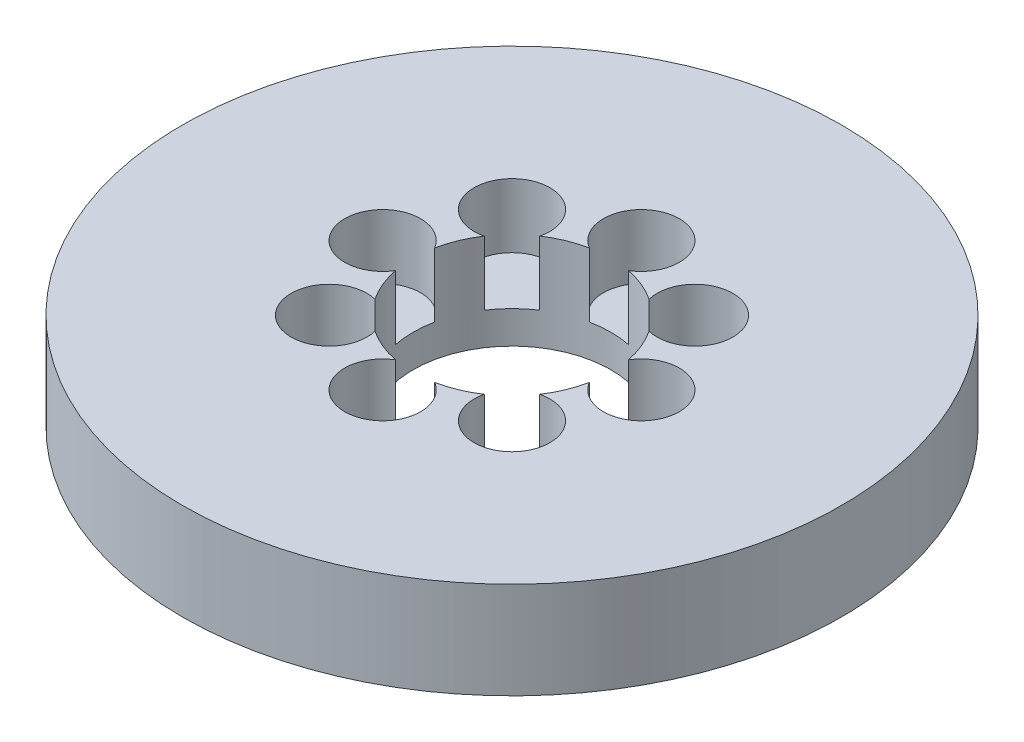
ISO-10303-21;
HEADER;
FILE_DESCRIPTION(('STEP AP214'),'2;1');
FILE_NAME('part.step','',(''),(''),'','','');
FILE_SCHEMA(('AUTOMOTIVE_DESIGN { 1 0 10303 214 1 1 1 1 }'));
ENDSEC;
DATA;
#1=APPLICATION_CONTEXT('core data for automotive mechanical design processes');
#2=APPLICATION_PROTOCOL_DEFINITION('international standard','automotive_design',2000,#1);
#3=PRODUCT_CONTEXT('',#1,'mechanical');
#4=PRODUCT('Part','Part','',(#3));
#5=PRODUCT_RELATED_PRODUCT_CATEGORY('part','',(#4));
#6=PRODUCT_DEFINITION_FORMATION('','',#4);
#7=PRODUCT_DEFINITION_CONTEXT('part definition',#1,'design');
#8=PRODUCT_DEFINITION('design','',#6,#7);
#9=PRODUCT_DEFINITION_SHAPE('','',#8);
#10=(LENGTH_UNIT() NAMED_UNIT(*) SI_UNIT(.MILLI.,.METRE.));
#11=(NAMED_UNIT(*) PLANE_ANGLE_UNIT() SI_UNIT($,.RADIAN.));
#12=(NAMED_UNIT(*) SI_UNIT($,.STERADIAN.) SOLID_ANGLE_UNIT());
#13=UNCERTAINTY_MEASURE_WITH_UNIT(LENGTH_MEASURE(1.E-05),#10,'distance_accuracy_value','');
#14=(GEOMETRIC_REPRESENTATION_CONTEXT(3) GLOBAL_UNCERTAINTY_ASSIGNED_CONTEXT((#13)) GLOBAL_UNIT_ASSIGNED_CONTEXT((#10,
#11,#12)) REPRESENTATION_CONTEXT('',''));
#15=CARTESIAN_POINT('',(0.,0.,0.));
#16=DIRECTION('',(0.,0.,1.));
#17=DIRECTION('',(1.,0.,0.));
#18=AXIS2_PLACEMENT_3D('',#15,#16,#17);
#19=CARTESIAN_POINT('',(0.,22.,0.));
#20=DIRECTION('',(0.,-1.,0.));
#21=DIRECTION('',(0.,0.,-1.));
#22=AXIS2_PLACEMENT_3D('',#19,#20,#21);
#23=CYLINDRICAL_SURFACE('',#22,75.);
#24=CARTESIAN_POINT('',(0.,22.,0.));
#25=DIRECTION('',(0.,1.,0.));
#26=DIRECTION('',(0.,0.,1.));
#27=AXIS2_PLACEMENT_3D('',#24,#25,#26);
#28=CIRCLE('',#27,75.);
#29=CARTESIAN_POINT('',(0.,22.,75.));
#30=VERTEX_POINT('',#29);
#31=EDGE_CURVE('E195',#30,#30,#28,.T.);
#32=ORIENTED_EDGE('',*,*,#31,.F.);
#33=EDGE_LOOP('',(#32));
#34=FACE_BOUND('',#33,.T.);
#35=CARTESIAN_POINT('',(0.,0.,0.));
#36=DIRECTION('',(0.,1.,0.));
#37=DIRECTION('',(0.,0.,1.));
#38=AXIS2_PLACEMENT_3D('',#35,#36,#37);
#39=CIRCLE('',#38,75.);
#40=CARTESIAN_POINT('',(0.,0.,75.));
#41=VERTEX_POINT('',#40);
#42=EDGE_CURVE('E179',#41,#41,#39,.T.);
#43=ORIENTED_EDGE('',*,*,#42,.T.);
#44=EDGE_LOOP('',(#43));
#45=FACE_BOUND('',#44,.T.);
#46=ADVANCED_FACE('F39',(#34,#45),#23,.T.);
#47=CARTESIAN_POINT('',(0.,22.,0.));
#48=DIRECTION('',(0.,1.,0.));
#49=DIRECTION('',(0.,0.,1.));
#50=AXIS2_PLACEMENT_3D('',#47,#48,#49);
#51=PLANE('',#50);
#52=CARTESIAN_POINT('',(1.02795736409459E-13,22.,29.4418690616628));
#53=DIRECTION('',(0.,1.,0.));
#54=DIRECTION('',(1.,0.,0.));
#55=AXIS2_PLACEMENT_3D('',#52,#53,#54);
#56=CIRCLE('',#55,8.63157592776677);
#57=CARTESIAN_POINT('',(-4.46210059535037,22.,22.0531099456964));
#58=VERTEX_POINT('',#57);
#59=CARTESIAN_POINT('',(4.46210059535052,22.,22.0531099456964));
#60=VERTEX_POINT('',#59);
#61=EDGE_CURVE('E176',#58,#60,#56,.T.);
#62=ORIENTED_EDGE('',*,*,#61,.F.);
#63=CARTESIAN_POINT('',(0.,22.,0.));
#64=DIRECTION('',(0.,1.,0.));
#65=DIRECTION('',(0.,0.,1.));
#66=AXIS2_PLACEMENT_3D('',#63,#64,#65);
#67=CIRCLE('',#66,22.5);
#68=CARTESIAN_POINT('',(-12.4387219995456,22.,18.7490851781633));
#69=VERTEX_POINT('',#68);
#70=EDGE_CURVE('E166',#69,#58,#67,.T.);
#71=ORIENTED_EDGE('',*,*,#70,.F.);
#72=CARTESIAN_POINT('',(-20.8185452643081,22.,20.8185452643082));
#73=DIRECTION('',(0.,1.,0.));
#74=DIRECTION('',(0.707106781186549,0.,0.707106781186546));
#75=AXIS2_PLACEMENT_3D('',#72,#73,#74);
#76=CIRCLE('',#75,8.63157592776677);
#77=CARTESIAN_POINT('',(-18.7490851781632,22.,12.4387219995456));
#78=VERTEX_POINT('',#77);
#79=EDGE_CURVE('E147',#78,#69,#76,.T.);
#80=ORIENTED_EDGE('',*,*,#79,.F.);
#81=CARTESIAN_POINT('',(-22.0531099456964,22.,4.46210059535045));
#82=VERTEX_POINT('',#81);
#83=EDGE_CURVE('E180',#82,#78,#67,.T.);
#84=ORIENTED_EDGE('',*,*,#83,.F.);
#85=CARTESIAN_POINT('',(-29.4418690616628,22.,0.));
#86=DIRECTION('',(0.,1.,0.));
#87=DIRECTION('',(0.,0.,1.));
#88=AXIS2_PLACEMENT_3D('',#85,#86,#87);
#89=CIRCLE('',#88,8.63157592776677);
#90=CARTESIAN_POINT('',(-22.0531099456964,22.,-4.46210059535045));
#91=VERTEX_POINT('',#90);
#92=EDGE_CURVE('E186',#91,#82,#89,.T.);
#93=ORIENTED_EDGE('',*,*,#92,.F.);
#94=CARTESIAN_POINT('',(-18.7490851781634,22.,-12.4387219995454));
#95=VERTEX_POINT('',#94);
#96=EDGE_CURVE('E182',#95,#91,#67,.T.);
#97=ORIENTED_EDGE('',*,*,#96,.F.);
#98=CARTESIAN_POINT('',(-20.8185452643084,22.,-20.8185452643079));
#99=DIRECTION('',(0.,1.,0.));
#100=DIRECTION('',(-0.707106781186539,0.,0.707106781186556));
#101=AXIS2_PLACEMENT_3D('',#98,#99,#100);
#102=CIRCLE('',#101,8.63157592776677);
#103=CARTESIAN_POINT('',(-12.4387219995458,22.,-18.7490851781631));
#104=VERTEX_POINT('',#103);
#105=EDGE_CURVE('E446',#104,#95,#102,.T.);
#106=ORIENTED_EDGE('',*,*,#105,.F.);
#107=CARTESIAN_POINT('',(-4.46210059535068,22.,-22.0531099456963));
#108=VERTEX_POINT('',#107);
#109=EDGE_CURVE('E452',#108,#104,#67,.T.);
#110=ORIENTED_EDGE('',*,*,#109,.F.);
#111=CARTESIAN_POINT('',(-3.08387209228376E-13,22.,-29.4418690616628));
#112=DIRECTION('',(0.,1.,0.));
#113=DIRECTION('',(-1.,0.,0.));
#114=AXIS2_PLACEMENT_3D('',#111,#112,#113);
#115=CIRCLE('',#114,8.63157592776677);
#116=CARTESIAN_POINT('',(4.46210059535022,22.,-22.0531099456964));
#117=VERTEX_POINT('',#116);
#118=EDGE_CURVE('E477',#117,#108,#115,.T.);
#119=ORIENTED_EDGE('',*,*,#118,.F.);
#120=CARTESIAN_POINT('',(12.4387219995454,22.,-18.7490851781634));
#121=VERTEX_POINT('',#120);
#122=EDGE_CURVE('E460',#121,#117,#67,.T.);
#123=ORIENTED_EDGE('',*,*,#122,.F.);
#124=CARTESIAN_POINT('',(20.818545264308,22.,-20.8185452643083));
#125=DIRECTION('',(0.,1.,0.));
#126=DIRECTION('',(-0.707106781186554,0.,-0.707106781186541));
#127=AXIS2_PLACEMENT_3D('',#124,#125,#126);
#128=CIRCLE('',#127,8.63157592776677);
#129=CARTESIAN_POINT('',(18.7490851781631,22.,-12.4387219995458));
#130=VERTEX_POINT('',#129);
#131=EDGE_CURVE('E464',#130,#121,#128,.T.);
#132=ORIENTED_EDGE('',*,*,#131,.F.);
#133=CARTESIAN_POINT('',(22.0531099456964,22.,-4.46210059535045));
#134=VERTEX_POINT('',#133);
#135=EDGE_CURVE('E459',#134,#130,#67,.T.);
#136=ORIENTED_EDGE('',*,*,#135,.F.);
#137=CARTESIAN_POINT('',(29.4418690616628,22.,0.));
#138=DIRECTION('',(0.,1.,0.));
#139=DIRECTION('',(0.,0.,-1.));
#140=AXIS2_PLACEMENT_3D('',#137,#138,#139);
#141=CIRCLE('',#140,8.63157592776677);
#142=CARTESIAN_POINT('',(22.0531099456964,22.,4.46210059535045));
#143=VERTEX_POINT('',#142);
#144=EDGE_CURVE('E469',#143,#134,#141,.T.);
#145=ORIENTED_EDGE('',*,*,#144,.F.);
#146=CARTESIAN_POINT('',(18.7490851781633,22.,12.4387219995455));
#147=VERTEX_POINT('',#146);
#148=EDGE_CURVE('E181',#147,#143,#67,.T.);
#149=ORIENTED_EDGE('',*,*,#148,.F.);
#150=CARTESIAN_POINT('',(20.8185452643083,22.,20.818545264308));
#151=DIRECTION('',(0.,1.,0.));
#152=DIRECTION('',(0.707106781186544,0.,-0.707106781186551));
#153=AXIS2_PLACEMENT_3D('',#150,#151,#152);
#154=CIRCLE('',#153,8.63157592776677);
#155=CARTESIAN_POINT('',(12.4387219995457,22.,18.7490851781632));
#156=VERTEX_POINT('',#155);
#157=EDGE_CURVE('E475',#156,#147,#154,.T.);
#158=ORIENTED_EDGE('',*,*,#157,.F.);
#159=EDGE_CURVE('E177',#60,#156,#67,.T.);
#160=ORIENTED_EDGE('',*,*,#159,.F.);
#161=EDGE_LOOP('',(#62,#71,#80,#84,#93,#97,#106,#110,#119,#123,#132,#136,#145,#149,#158,#160));
#162=FACE_BOUND('',#161,.T.);
#163=ORIENTED_EDGE('',*,*,#31,.T.);
#164=EDGE_LOOP('',(#163));
#165=FACE_BOUND('',#164,.T.);
#166=ADVANCED_FACE('F172',(#162,#165),#51,.T.);
#167=CARTESIAN_POINT('',(0.,0.,0.));
#168=DIRECTION('',(0.,1.,0.));
#169=DIRECTION('',(0.,0.,1.));
#170=AXIS2_PLACEMENT_3D('',#167,#168,#169);
#171=PLANE('',#170);
#172=CARTESIAN_POINT('',(0.,0.,0.));
#173=DIRECTION('',(0.,1.,0.));
#174=DIRECTION('',(0.,0.,1.));
#175=AXIS2_PLACEMENT_3D('',#172,#173,#174);
#176=CIRCLE('',#175,22.5);
#177=CARTESIAN_POINT('',(0.,0.,22.5));
#178=VERTEX_POINT('',#177);
#179=EDGE_CURVE('E187',#178,#178,#176,.T.);
#180=ORIENTED_EDGE('',*,*,#179,.T.);
#181=EDGE_LOOP('',(#180));
#182=FACE_BOUND('',#181,.T.);
#183=ORIENTED_EDGE('',*,*,#42,.F.);
#184=EDGE_LOOP('',(#183));
#185=FACE_BOUND('',#184,.T.);
#186=ADVANCED_FACE('F270',(#182,#185),#171,.F.);
#187=CARTESIAN_POINT('',(0.,22.,0.));
#188=DIRECTION('',(0.,-1.,0.));
#189=DIRECTION('',(0.,0.,-1.));
#190=AXIS2_PLACEMENT_3D('',#187,#188,#189);
#191=CYLINDRICAL_SURFACE('',#190,22.5);
#192=DIRECTION('',(0.,1.,0.));
#193=VECTOR('',#192,1.);
#194=CARTESIAN_POINT('',(-4.46210059535036,14.6994537194091,22.0531099456964));
#195=LINE('',#194,#193);
#196=CARTESIAN_POINT('',(-4.46210059535037,7.3989074388182,22.0531099456964));
#197=VERTEX_POINT('',#196);
#198=EDGE_CURVE('E11',#197,#58,#195,.T.);
#199=ORIENTED_EDGE('',*,*,#198,.F.);
#200=CARTESIAN_POINT('',(0.,7.3989074388182,0.));
#201=DIRECTION('',(0.,1.,0.));
#202=DIRECTION('',(0.,0.,1.));
#203=AXIS2_PLACEMENT_3D('',#200,#201,#202);
#204=CIRCLE('',#203,22.5);
#205=CARTESIAN_POINT('',(4.46210059535052,7.3989074388182,22.0531099456964));
#206=VERTEX_POINT('',#205);
#207=EDGE_CURVE('E250',#197,#206,#204,.T.);
#208=ORIENTED_EDGE('',*,*,#207,.T.);
#209=DIRECTION('',(0.,1.,0.));
#210=VECTOR('',#209,1.);
#211=CARTESIAN_POINT('',(4.46210059535052,14.6994537194091,22.0531099456964));
#212=LINE('',#211,#210);
#213=EDGE_CURVE('E46',#60,#206,#212,.F.);
#214=ORIENTED_EDGE('',*,*,#213,.F.);
#215=ORIENTED_EDGE('',*,*,#159,.T.);
#216=DIRECTION('',(0.,1.,0.));
#217=VECTOR('',#216,1.);
#218=CARTESIAN_POINT('',(12.4387219995457,14.6994537194091,18.7490851781632));
#219=LINE('',#218,#217);
#220=CARTESIAN_POINT('',(12.4387219995457,7.3989074388182,18.7490851781632));
#221=VERTEX_POINT('',#220);
#222=EDGE_CURVE('E244',#221,#156,#219,.T.);
#223=ORIENTED_EDGE('',*,*,#222,.F.);
#224=CARTESIAN_POINT('',(0.,7.3989074388182,0.));
#225=DIRECTION('',(0.,1.,0.));
#226=DIRECTION('',(0.,0.,1.));
#227=AXIS2_PLACEMENT_3D('',#224,#225,#226);
#228=CIRCLE('',#227,22.5);
#229=CARTESIAN_POINT('',(18.7490851781633,7.3989074388182,12.4387219995455));
#230=VERTEX_POINT('',#229);
#231=EDGE_CURVE('E238',#221,#230,#228,.T.);
#232=ORIENTED_EDGE('',*,*,#231,.T.);
#233=DIRECTION('',(0.,1.,0.));
#234=VECTOR('',#233,1.);
#235=CARTESIAN_POINT('',(18.7490851781633,14.6994537194091,12.4387219995455));
#236=LINE('',#235,#234);
#237=EDGE_CURVE('E242',#147,#230,#236,.F.);
#238=ORIENTED_EDGE('',*,*,#237,.F.);
#239=ORIENTED_EDGE('',*,*,#148,.T.);
#240=DIRECTION('',(0.,1.,0.));
#241=VECTOR('',#240,1.);
#242=CARTESIAN_POINT('',(22.0531099456964,14.6994537194091,4.46210059535044));
#243=LINE('',#242,#241);
#244=CARTESIAN_POINT('',(22.0531099456964,7.3989074388182,4.46210059535045));
#245=VERTEX_POINT('',#244);
#246=EDGE_CURVE('E236',#245,#143,#243,.T.);
#247=ORIENTED_EDGE('',*,*,#246,.F.);
#248=CARTESIAN_POINT('',(0.,7.3989074388182,0.));
#249=DIRECTION('',(0.,1.,0.));
#250=DIRECTION('',(0.,0.,1.));
#251=AXIS2_PLACEMENT_3D('',#248,#249,#250);
#252=CIRCLE('',#251,22.5);
#253=CARTESIAN_POINT('',(22.0531099456964,7.3989074388182,-4.46210059535045));
#254=VERTEX_POINT('',#253);
#255=EDGE_CURVE('E235',#245,#254,#252,.T.);
#256=ORIENTED_EDGE('',*,*,#255,.T.);
#257=DIRECTION('',(0.,1.,0.));
#258=VECTOR('',#257,1.);
#259=CARTESIAN_POINT('',(22.0531099456964,14.6994537194091,-4.46210059535044));
#260=LINE('',#259,#258);
#261=EDGE_CURVE('E234',#134,#254,#260,.F.);
#262=ORIENTED_EDGE('',*,*,#261,.F.);
#263=ORIENTED_EDGE('',*,*,#135,.T.);
#264=DIRECTION('',(0.,1.,0.));
#265=VECTOR('',#264,1.);
#266=CARTESIAN_POINT('',(18.7490851781631,14.6994537194091,-12.4387219995458));
#267=LINE('',#266,#265);
#268=CARTESIAN_POINT('',(18.7490851781631,7.3989074388182,-12.4387219995458));
#269=VERTEX_POINT('',#268);
#270=EDGE_CURVE('E229',#269,#130,#267,.T.);
#271=ORIENTED_EDGE('',*,*,#270,.F.);
#272=CARTESIAN_POINT('',(0.,7.3989074388182,0.));
#273=DIRECTION('',(0.,1.,0.));
#274=DIRECTION('',(0.,0.,1.));
#275=AXIS2_PLACEMENT_3D('',#272,#273,#274);
#276=CIRCLE('',#275,22.5);
#277=CARTESIAN_POINT('',(12.4387219995454,7.3989074388182,-18.7490851781634));
#278=VERTEX_POINT('',#277);
#279=EDGE_CURVE('E221',#269,#278,#276,.T.);
#280=ORIENTED_EDGE('',*,*,#279,.T.);
#281=DIRECTION('',(0.,1.,0.));
#282=VECTOR('',#281,1.);
#283=CARTESIAN_POINT('',(12.4387219995454,14.6994537194091,-18.7490851781633));
#284=LINE('',#283,#282);
#285=EDGE_CURVE('E230',#121,#278,#284,.F.);
#286=ORIENTED_EDGE('',*,*,#285,.F.);
#287=ORIENTED_EDGE('',*,*,#122,.T.);
#288=DIRECTION('',(0.,1.,0.));
#289=VECTOR('',#288,1.);
#290=CARTESIAN_POINT('',(4.46210059535021,14.6994537194091,-22.0531099456964));
#291=LINE('',#290,#289);
#292=CARTESIAN_POINT('',(4.46210059535022,7.3989074388182,-22.0531099456964));
#293=VERTEX_POINT('',#292);
#294=EDGE_CURVE('E225',#293,#117,#291,.T.);
#295=ORIENTED_EDGE('',*,*,#294,.F.);
#296=CARTESIAN_POINT('',(0.,7.3989074388182,0.));
#297=DIRECTION('',(0.,1.,0.));
#298=DIRECTION('',(0.,0.,1.));
#299=AXIS2_PLACEMENT_3D('',#296,#297,#298);
#300=CIRCLE('',#299,22.5);
#301=CARTESIAN_POINT('',(-4.46210059535068,7.3989074388182,-22.0531099456963));
#302=VERTEX_POINT('',#301);
#303=EDGE_CURVE('E216',#293,#302,#300,.T.);
#304=ORIENTED_EDGE('',*,*,#303,.T.);
#305=DIRECTION('',(0.,1.,0.));
#306=VECTOR('',#305,1.);
#307=CARTESIAN_POINT('',(-4.46210059535067,14.6994537194091,-22.0531099456963));
#308=LINE('',#307,#306);
#309=EDGE_CURVE('E218',#108,#302,#308,.F.);
#310=ORIENTED_EDGE('',*,*,#309,.F.);
#311=ORIENTED_EDGE('',*,*,#109,.T.);
#312=DIRECTION('',(0.,1.,0.));
#313=VECTOR('',#312,1.);
#314=CARTESIAN_POINT('',(-12.4387219995458,14.6994537194091,-18.7490851781631));
#315=LINE('',#314,#313);
#316=CARTESIAN_POINT('',(-12.4387219995458,7.3989074388182,-18.7490851781631));
#317=VERTEX_POINT('',#316);
#318=EDGE_CURVE('E212',#317,#104,#315,.T.);
#319=ORIENTED_EDGE('',*,*,#318,.F.);
#320=CARTESIAN_POINT('',(0.,7.3989074388182,0.));
#321=DIRECTION('',(0.,1.,0.));
#322=DIRECTION('',(0.,0.,1.));
#323=AXIS2_PLACEMENT_3D('',#320,#321,#322);
#324=CIRCLE('',#323,22.5);
#325=CARTESIAN_POINT('',(-18.7490851781634,7.3989074388182,-12.4387219995454));
#326=VERTEX_POINT('',#325);
#327=EDGE_CURVE('E208',#317,#326,#324,.T.);
#328=ORIENTED_EDGE('',*,*,#327,.T.);
#329=DIRECTION('',(0.,1.,0.));
#330=VECTOR('',#329,1.);
#331=CARTESIAN_POINT('',(-18.7490851781634,14.6994537194091,-12.4387219995454));
#332=LINE('',#331,#330);
#333=EDGE_CURVE('E211',#95,#326,#332,.F.);
#334=ORIENTED_EDGE('',*,*,#333,.F.);
#335=ORIENTED_EDGE('',*,*,#96,.T.);
#336=DIRECTION('',(0.,1.,0.));
#337=VECTOR('',#336,1.);
#338=CARTESIAN_POINT('',(-22.0531099456964,14.6994537194091,-4.46210059535044));
#339=LINE('',#338,#337);
#340=CARTESIAN_POINT('',(-22.0531099456964,7.3989074388182,-4.46210059535045));
#341=VERTEX_POINT('',#340);
#342=EDGE_CURVE('E201',#341,#91,#339,.T.);
#343=ORIENTED_EDGE('',*,*,#342,.F.);
#344=CARTESIAN_POINT('',(0.,7.3989074388182,0.));
#345=DIRECTION('',(0.,1.,0.));
#346=DIRECTION('',(0.,0.,1.));
#347=AXIS2_PLACEMENT_3D('',#344,#345,#346);
#348=CIRCLE('',#347,22.5);
#349=CARTESIAN_POINT('',(-22.0531099456964,7.3989074388182,4.46210059535045));
#350=VERTEX_POINT('',#349);
#351=EDGE_CURVE('E194',#341,#350,#348,.T.);
#352=ORIENTED_EDGE('',*,*,#351,.T.);
#353=DIRECTION('',(0.,1.,0.));
#354=VECTOR('',#353,1.);
#355=CARTESIAN_POINT('',(-22.0531099456964,14.6994537194091,4.46210059535044));
#356=LINE('',#355,#354);
#357=EDGE_CURVE('E199',#82,#350,#356,.F.);
#358=ORIENTED_EDGE('',*,*,#357,.F.);
#359=ORIENTED_EDGE('',*,*,#83,.T.);
#360=DIRECTION('',(0.,1.,0.));
#361=VECTOR('',#360,1.);
#362=CARTESIAN_POINT('',(-18.7490851781632,14.6994537194091,12.4387219995456));
#363=LINE('',#362,#361);
#364=CARTESIAN_POINT('',(-18.7490851781632,7.3989074388182,12.4387219995456));
#365=VERTEX_POINT('',#364);
#366=EDGE_CURVE('E160',#365,#78,#363,.T.);
#367=ORIENTED_EDGE('',*,*,#366,.F.);
#368=CARTESIAN_POINT('',(0.,7.3989074388182,0.));
#369=DIRECTION('',(0.,1.,0.));
#370=DIRECTION('',(0.,0.,1.));
#371=AXIS2_PLACEMENT_3D('',#368,#369,#370);
#372=CIRCLE('',#371,22.5);
#373=CARTESIAN_POINT('',(-12.4387219995456,7.3989074388182,18.7490851781633));
#374=VERTEX_POINT('',#373);
#375=EDGE_CURVE('E168',#365,#374,#372,.T.);
#376=ORIENTED_EDGE('',*,*,#375,.T.);
#377=DIRECTION('',(0.,1.,0.));
#378=VECTOR('',#377,1.);
#379=CARTESIAN_POINT('',(-12.4387219995456,14.6994537194091,18.7490851781633));
#380=LINE('',#379,#378);
#381=EDGE_CURVE('E152',#69,#374,#380,.F.);
#382=ORIENTED_EDGE('',*,*,#381,.F.);
#383=ORIENTED_EDGE('',*,*,#70,.T.);
#384=EDGE_LOOP('',(#199,#208,#214,#215,#223,#232,#238,#239,#247,#256,#262,#263,#271,#280,#286,
#287,#295,#304,#310,#311,#319,#328,#334,#335,#343,#352,#358,#359,#367,#376,#382,#383));
#385=FACE_BOUND('',#384,.T.);
#386=ORIENTED_EDGE('',*,*,#179,.F.);
#387=EDGE_LOOP('',(#386));
#388=FACE_BOUND('',#387,.T.);
#389=ADVANCED_FACE('F170',(#385,#388),#191,.F.);
#390=CARTESIAN_POINT('',(-29.4418690616628,7.3989074388182,0.));
#391=DIRECTION('',(0.,1.,0.));
#392=DIRECTION('',(0.,0.,1.));
#393=AXIS2_PLACEMENT_3D('',#390,#391,#392);
#394=CYLINDRICAL_SURFACE('',#393,8.63157592776677);
#395=ORIENTED_EDGE('',*,*,#342,.T.);
#396=ORIENTED_EDGE('',*,*,#92,.T.);
#397=ORIENTED_EDGE('',*,*,#357,.T.);
#398=CARTESIAN_POINT('',(-29.4418690616628,7.3989074388182,0.));
#399=DIRECTION('',(0.,1.,0.));
#400=DIRECTION('',(0.,0.,1.));
#401=AXIS2_PLACEMENT_3D('',#398,#399,#400);
#402=CIRCLE('',#401,8.63157592776677);
#403=EDGE_CURVE('E191',#341,#350,#402,.T.);
#404=ORIENTED_EDGE('',*,*,#403,.F.);
#405=EDGE_LOOP('',(#395,#396,#397,#404));
#406=FACE_BOUND('',#405,.T.);
#407=ADVANCED_FACE('F279',(#406),#394,.F.);
#408=CARTESIAN_POINT('',(-29.4418690616628,7.3989074388182,0.));
#409=DIRECTION('',(0.,1.,0.));
#410=DIRECTION('',(0.,0.,1.));
#411=AXIS2_PLACEMENT_3D('',#408,#409,#410);
#412=PLANE('',#411);
#413=ORIENTED_EDGE('',*,*,#403,.T.);
#414=ORIENTED_EDGE('',*,*,#351,.F.);
#415=EDGE_LOOP('',(#413,#414));
#416=FACE_BOUND('',#415,.T.);
#417=ADVANCED_FACE('F285',(#416),#412,.T.);
#418=CARTESIAN_POINT('',(-20.8185452643081,7.3989074388182,20.8185452643082));
#419=DIRECTION('',(0.,1.,0.));
#420=DIRECTION('',(0.,0.,1.));
#421=AXIS2_PLACEMENT_3D('',#418,#419,#420);
#422=CYLINDRICAL_SURFACE('',#421,8.63157592776677);
#423=ORIENTED_EDGE('',*,*,#366,.T.);
#424=ORIENTED_EDGE('',*,*,#79,.T.);
#425=ORIENTED_EDGE('',*,*,#381,.T.);
#426=CARTESIAN_POINT('',(-20.8185452643081,7.3989074388182,20.8185452643082));
#427=DIRECTION('',(0.,1.,0.));
#428=DIRECTION('',(0.707106781186549,0.,0.707106781186546));
#429=AXIS2_PLACEMENT_3D('',#426,#427,#428);
#430=CIRCLE('',#429,8.63157592776677);
#431=EDGE_CURVE('E165',#365,#374,#430,.T.);
#432=ORIENTED_EDGE('',*,*,#431,.F.);
#433=EDGE_LOOP('',(#423,#424,#425,#432));
#434=FACE_BOUND('',#433,.T.);
#435=ADVANCED_FACE('F155',(#434),#422,.F.);
#436=CARTESIAN_POINT('',(-20.8185452643081,7.3989074388182,20.8185452643082));
#437=DIRECTION('',(0.,1.,0.));
#438=DIRECTION('',(0.707106781186549,0.,0.707106781186546));
#439=AXIS2_PLACEMENT_3D('',#436,#437,#438);
#440=PLANE('',#439);
#441=ORIENTED_EDGE('',*,*,#431,.T.);
#442=ORIENTED_EDGE('',*,*,#375,.F.);
#443=EDGE_LOOP('',(#441,#442));
#444=FACE_BOUND('',#443,.T.);
#445=ADVANCED_FACE('F288',(#444),#440,.T.);
#446=CARTESIAN_POINT('',(-20.8185452643084,7.3989074388182,-20.8185452643079));
#447=DIRECTION('',(0.,1.,0.));
#448=DIRECTION('',(0.,0.,1.));
#449=AXIS2_PLACEMENT_3D('',#446,#447,#448);
#450=CYLINDRICAL_SURFACE('',#449,8.63157592776677);
#451=ORIENTED_EDGE('',*,*,#318,.T.);
#452=ORIENTED_EDGE('',*,*,#105,.T.);
#453=ORIENTED_EDGE('',*,*,#333,.T.);
#454=CARTESIAN_POINT('',(-20.8185452643084,7.3989074388182,-20.8185452643079));
#455=DIRECTION('',(0.,1.,0.));
#456=DIRECTION('',(-0.707106781186539,0.,0.707106781186556));
#457=AXIS2_PLACEMENT_3D('',#454,#455,#456);
#458=CIRCLE('',#457,8.63157592776677);
#459=EDGE_CURVE('E447',#317,#326,#458,.T.);
#460=ORIENTED_EDGE('',*,*,#459,.F.);
#461=EDGE_LOOP('',(#451,#452,#453,#460));
#462=FACE_BOUND('',#461,.T.);
#463=ADVANCED_FACE('F295',(#462),#450,.F.);
#464=CARTESIAN_POINT('',(-20.8185452643084,7.3989074388182,-20.8185452643079));
#465=DIRECTION('',(0.,1.,0.));
#466=DIRECTION('',(-0.707106781186539,0.,0.707106781186556));
#467=AXIS2_PLACEMENT_3D('',#464,#465,#466);
#468=PLANE('',#467);
#469=ORIENTED_EDGE('',*,*,#459,.T.);
#470=ORIENTED_EDGE('',*,*,#327,.F.);
#471=EDGE_LOOP('',(#469,#470));
#472=FACE_BOUND('',#471,.T.);
#473=ADVANCED_FACE('F375',(#472),#468,.T.);
#474=CARTESIAN_POINT('',(-3.08387209228376E-13,7.3989074388182,-29.4418690616628));
#475=DIRECTION('',(0.,1.,0.));
#476=DIRECTION('',(0.,0.,1.));
#477=AXIS2_PLACEMENT_3D('',#474,#475,#476);
#478=CYLINDRICAL_SURFACE('',#477,8.63157592776677);
#479=ORIENTED_EDGE('',*,*,#294,.T.);
#480=ORIENTED_EDGE('',*,*,#118,.T.);
#481=ORIENTED_EDGE('',*,*,#309,.T.);
#482=CARTESIAN_POINT('',(-3.08387209228376E-13,7.3989074388182,-29.4418690616628));
#483=DIRECTION('',(0.,1.,0.));
#484=DIRECTION('',(-1.,0.,0.));
#485=AXIS2_PLACEMENT_3D('',#482,#483,#484);
#486=CIRCLE('',#485,8.63157592776677);
#487=EDGE_CURVE('E467',#293,#302,#486,.T.);
#488=ORIENTED_EDGE('',*,*,#487,.F.);
#489=EDGE_LOOP('',(#479,#480,#481,#488));
#490=FACE_BOUND('',#489,.T.);
#491=ADVANCED_FACE('F361',(#490),#478,.F.);
#492=CARTESIAN_POINT('',(-3.08387209228376E-13,7.3989074388182,-29.4418690616628));
#493=DIRECTION('',(0.,1.,0.));
#494=DIRECTION('',(-1.,0.,0.));
#495=AXIS2_PLACEMENT_3D('',#492,#493,#494);
#496=PLANE('',#495);
#497=ORIENTED_EDGE('',*,*,#487,.T.);
#498=ORIENTED_EDGE('',*,*,#303,.F.);
#499=EDGE_LOOP('',(#497,#498));
#500=FACE_BOUND('',#499,.T.);
#501=ADVANCED_FACE('F297',(#500),#496,.T.);
#502=CARTESIAN_POINT('',(20.818545264308,7.3989074388182,-20.8185452643083));
#503=DIRECTION('',(0.,1.,0.));
#504=DIRECTION('',(0.,0.,1.));
#505=AXIS2_PLACEMENT_3D('',#502,#503,#504);
#506=CYLINDRICAL_SURFACE('',#505,8.63157592776677);
#507=ORIENTED_EDGE('',*,*,#270,.T.);
#508=ORIENTED_EDGE('',*,*,#131,.T.);
#509=ORIENTED_EDGE('',*,*,#285,.T.);
#510=CARTESIAN_POINT('',(20.818545264308,7.3989074388182,-20.8185452643083));
#511=DIRECTION('',(0.,1.,0.));
#512=DIRECTION('',(-0.707106781186554,0.,-0.707106781186541));
#513=AXIS2_PLACEMENT_3D('',#510,#511,#512);
#514=CIRCLE('',#513,8.63157592776677);
#515=EDGE_CURVE('E470',#269,#278,#514,.T.);
#516=ORIENTED_EDGE('',*,*,#515,.F.);
#517=EDGE_LOOP('',(#507,#508,#509,#516));
#518=FACE_BOUND('',#517,.T.);
#519=ADVANCED_FACE('F294',(#518),#506,.F.);
#520=CARTESIAN_POINT('',(20.818545264308,7.3989074388182,-20.8185452643083));
#521=DIRECTION('',(0.,1.,0.));
#522=DIRECTION('',(-0.707106781186554,0.,-0.707106781186541));
#523=AXIS2_PLACEMENT_3D('',#520,#521,#522);
#524=PLANE('',#523);
#525=ORIENTED_EDGE('',*,*,#515,.T.);
#526=ORIENTED_EDGE('',*,*,#279,.F.);
#527=EDGE_LOOP('',(#525,#526));
#528=FACE_BOUND('',#527,.T.);
#529=ADVANCED_FACE('F300',(#528),#524,.T.);
#530=CARTESIAN_POINT('',(29.4418690616628,7.3989074388182,0.));
#531=DIRECTION('',(0.,1.,0.));
#532=DIRECTION('',(0.,0.,1.));
#533=AXIS2_PLACEMENT_3D('',#530,#531,#532);
#534=CYLINDRICAL_SURFACE('',#533,8.63157592776677);
#535=ORIENTED_EDGE('',*,*,#246,.T.);
#536=ORIENTED_EDGE('',*,*,#144,.T.);
#537=ORIENTED_EDGE('',*,*,#261,.T.);
#538=CARTESIAN_POINT('',(29.4418690616628,7.3989074388182,0.));
#539=DIRECTION('',(0.,1.,0.));
#540=DIRECTION('',(0.,0.,-1.));
#541=AXIS2_PLACEMENT_3D('',#538,#539,#540);
#542=CIRCLE('',#541,8.63157592776677);
#543=EDGE_CURVE('E472',#245,#254,#542,.T.);
#544=ORIENTED_EDGE('',*,*,#543,.F.);
#545=EDGE_LOOP('',(#535,#536,#537,#544));
#546=FACE_BOUND('',#545,.T.);
#547=ADVANCED_FACE('F305',(#546),#534,.F.);
#548=CARTESIAN_POINT('',(29.4418690616628,7.3989074388182,0.));
#549=DIRECTION('',(0.,1.,0.));
#550=DIRECTION('',(0.,0.,-1.));
#551=AXIS2_PLACEMENT_3D('',#548,#549,#550);
#552=PLANE('',#551);
#553=ORIENTED_EDGE('',*,*,#543,.T.);
#554=ORIENTED_EDGE('',*,*,#255,.F.);
#555=EDGE_LOOP('',(#553,#554));
#556=FACE_BOUND('',#555,.T.);
#557=ADVANCED_FACE('F308',(#556),#552,.T.);
#558=CARTESIAN_POINT('',(20.8185452643083,7.3989074388182,20.818545264308));
#559=DIRECTION('',(0.,1.,0.));
#560=DIRECTION('',(0.,0.,1.));
#561=AXIS2_PLACEMENT_3D('',#558,#559,#560);
#562=CYLINDRICAL_SURFACE('',#561,8.63157592776677);
#563=ORIENTED_EDGE('',*,*,#222,.T.);
#564=ORIENTED_EDGE('',*,*,#157,.T.);
#565=ORIENTED_EDGE('',*,*,#237,.T.);
#566=CARTESIAN_POINT('',(20.8185452643083,7.3989074388182,20.818545264308));
#567=DIRECTION('',(0.,1.,0.));
#568=DIRECTION('',(0.707106781186544,0.,-0.707106781186551));
#569=AXIS2_PLACEMENT_3D('',#566,#567,#568);
#570=CIRCLE('',#569,8.63157592776677);
#571=EDGE_CURVE('E56',#221,#230,#570,.T.);
#572=ORIENTED_EDGE('',*,*,#571,.F.);
#573=EDGE_LOOP('',(#563,#564,#565,#572));
#574=FACE_BOUND('',#573,.T.);
#575=ADVANCED_FACE('F309',(#574),#562,.F.);
#576=CARTESIAN_POINT('',(20.8185452643083,7.3989074388182,20.818545264308));
#577=DIRECTION('',(0.,1.,0.));
#578=DIRECTION('',(0.707106781186544,0.,-0.707106781186551));
#579=AXIS2_PLACEMENT_3D('',#576,#577,#578);
#580=PLANE('',#579);
#581=ORIENTED_EDGE('',*,*,#571,.T.);
#582=ORIENTED_EDGE('',*,*,#231,.F.);
#583=EDGE_LOOP('',(#581,#582));
#584=FACE_BOUND('',#583,.T.);
#585=ADVANCED_FACE('F256',(#584),#580,.T.);
#586=CARTESIAN_POINT('',(1.02795736409459E-13,7.3989074388182,29.4418690616628));
#587=DIRECTION('',(0.,1.,0.));
#588=DIRECTION('',(0.,0.,1.));
#589=AXIS2_PLACEMENT_3D('',#586,#587,#588);
#590=CYLINDRICAL_SURFACE('',#589,8.63157592776677);
#591=ORIENTED_EDGE('',*,*,#198,.T.);
#592=ORIENTED_EDGE('',*,*,#61,.T.);
#593=ORIENTED_EDGE('',*,*,#213,.T.);
#594=CARTESIAN_POINT('',(1.02795736409459E-13,7.3989074388182,29.4418690616628));
#595=DIRECTION('',(0.,1.,0.));
#596=DIRECTION('',(1.,0.,0.));
#597=AXIS2_PLACEMENT_3D('',#594,#595,#596);
#598=CIRCLE('',#597,8.63157592776677);
#599=EDGE_CURVE('E55',#197,#206,#598,.T.);
#600=ORIENTED_EDGE('',*,*,#599,.F.);
#601=EDGE_LOOP('',(#591,#592,#593,#600));
#602=FACE_BOUND('',#601,.T.);
#603=ADVANCED_FACE('F253',(#602),#590,.F.);
#604=CARTESIAN_POINT('',(1.02795736409459E-13,7.3989074388182,29.4418690616628));
#605=DIRECTION('',(0.,1.,0.));
#606=DIRECTION('',(1.,0.,0.));
#607=AXIS2_PLACEMENT_3D('',#604,#605,#606);
#608=PLANE('',#607);
#609=ORIENTED_EDGE('',*,*,#599,.T.);
#610=ORIENTED_EDGE('',*,*,#207,.F.);
#611=EDGE_LOOP('',(#609,#610));
#612=FACE_BOUND('',#611,.T.);
#613=ADVANCED_FACE('F252',(#612),#608,.T.);
#614=CLOSED_SHELL('',(#46,#166,#186,#389,#407,#417,#435,#445,#463,#473,#491,#501,#519,#529,#547,
#557,#575,#585,#603,#613));
#615=MANIFOLD_SOLID_BREP('B2',#614);
#616=ADVANCED_BREP_SHAPE_REPRESENTATION('',(#18,#615),#14);
#617=SHAPE_DEFINITION_REPRESENTATION(#9,#616);
ENDSEC;
END-ISO-10303-21;
